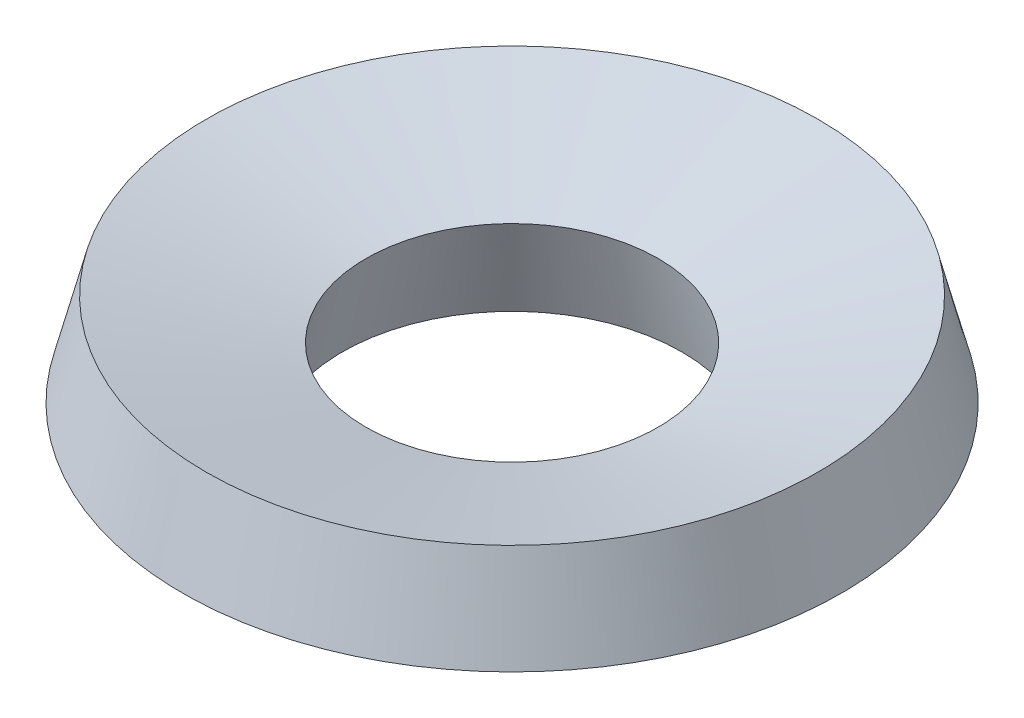
ISO-10303-21;
HEADER;
FILE_DESCRIPTION(('STEP AP214'),'2;1');
FILE_NAME('part.step','',(''),(''),'','','');
FILE_SCHEMA(('AUTOMOTIVE_DESIGN { 1 0 10303 214 1 1 1 1 }'));
ENDSEC;
DATA;
#1=APPLICATION_CONTEXT('core data for automotive mechanical design processes');
#2=APPLICATION_PROTOCOL_DEFINITION('international standard','automotive_design',2000,#1);
#3=PRODUCT_CONTEXT('',#1,'mechanical');
#4=PRODUCT('Part','Part','',(#3));
#5=PRODUCT_RELATED_PRODUCT_CATEGORY('part','',(#4));
#6=PRODUCT_DEFINITION_FORMATION('','',#4);
#7=PRODUCT_DEFINITION_CONTEXT('part definition',#1,'design');
#8=PRODUCT_DEFINITION('design','',#6,#7);
#9=PRODUCT_DEFINITION_SHAPE('','',#8);
#10=(LENGTH_UNIT() NAMED_UNIT(*) SI_UNIT(.MILLI.,.METRE.));
#11=(NAMED_UNIT(*) PLANE_ANGLE_UNIT() SI_UNIT($,.RADIAN.));
#12=(NAMED_UNIT(*) SI_UNIT($,.STERADIAN.) SOLID_ANGLE_UNIT());
#13=UNCERTAINTY_MEASURE_WITH_UNIT(LENGTH_MEASURE(1.E-05),#10,'distance_accuracy_value','');
#14=(GEOMETRIC_REPRESENTATION_CONTEXT(3) GLOBAL_UNCERTAINTY_ASSIGNED_CONTEXT((#13)) GLOBAL_UNIT_ASSIGNED_CONTEXT((#10,
#11,#12)) REPRESENTATION_CONTEXT('',''));
#15=CARTESIAN_POINT('',(0.,0.,0.));
#16=DIRECTION('',(0.,0.,1.));
#17=DIRECTION('',(1.,0.,0.));
#18=AXIS2_PLACEMENT_3D('',#15,#16,#17);
#19=CARTESIAN_POINT('',(0.,5.0000000000407,0.));
#20=DIRECTION('',(0.,1.,0.));
#21=DIRECTION('',(-1.,0.,0.));
#22=AXIS2_PLACEMENT_3D('',#19,#20,#21);
#23=CONICAL_SURFACE('',#22,16.4709302325896,1.32035323718);
#24=CARTESIAN_POINT('',(0.,2.79999999999971,0.));
#25=DIRECTION('',(0.,-1.,0.));
#26=DIRECTION('',(0.,0.,-1.));
#27=AXIS2_PLACEMENT_3D('',#24,#25,#26);
#28=CIRCLE('',#27,7.87093023255887);
#29=CARTESIAN_POINT('',(0.,2.79999999999971,-7.87093023255887));
#30=VERTEX_POINT('',#29);
#31=EDGE_CURVE('E18',#30,#30,#28,.T.);
#32=ORIENTED_EDGE('',*,*,#31,.T.);
#33=EDGE_LOOP('',(#32));
#34=FACE_BOUND('',#33,.T.);
#35=CARTESIAN_POINT('',(0.,4.99999999998771,0.));
#36=DIRECTION('',(0.,-1.,0.));
#37=DIRECTION('',(0.,0.,-1.));
#38=AXIS2_PLACEMENT_3D('',#35,#36,#37);
#39=CIRCLE('',#38,16.4709302325519);
#40=CARTESIAN_POINT('',(0.,4.99999999998771,-16.4709302325519));
#41=VERTEX_POINT('',#40);
#42=EDGE_CURVE('E27',#41,#41,#39,.T.);
#43=ORIENTED_EDGE('',*,*,#42,.F.);
#44=EDGE_LOOP('',(#43));
#45=FACE_BOUND('',#44,.T.);
#46=ADVANCED_FACE('F15',(#34,#45),#23,.F.);
#47=CARTESIAN_POINT('',(0.,-2.20000000000029,0.));
#48=DIRECTION('',(0.,-1.,0.));
#49=DIRECTION('',(1.,0.,0.));
#50=AXIS2_PLACEMENT_3D('',#47,#48,#49);
#51=CONICAL_SURFACE('',#50,9.14999999999886,0.250443089611);
#52=CARTESIAN_POINT('',(0.,-2.19999999999939,0.));
#53=DIRECTION('',(0.,1.,0.));
#54=DIRECTION('',(0.,0.,-1.));
#55=AXIS2_PLACEMENT_3D('',#52,#53,#54);
#56=CIRCLE('',#55,9.14999999999984);
#57=CARTESIAN_POINT('',(0.,-2.19999999999939,-9.14999999999984));
#58=VERTEX_POINT('',#57);
#59=EDGE_CURVE('E22',#58,#58,#56,.T.);
#60=ORIENTED_EDGE('',*,*,#59,.F.);
#61=EDGE_LOOP('',(#60));
#62=FACE_BOUND('',#61,.T.);
#63=ORIENTED_EDGE('',*,*,#31,.F.);
#64=EDGE_LOOP('',(#63));
#65=FACE_BOUND('',#64,.T.);
#66=ADVANCED_FACE('F37',(#62,#65),#51,.F.);
#67=CARTESIAN_POINT('',(0.,-2.69055611124003E-12,0.));
#68=DIRECTION('',(0.,-1.,0.));
#69=DIRECTION('',(1.,0.,0.));
#70=AXIS2_PLACEMENT_3D('',#67,#68,#69);
#71=CONICAL_SURFACE('',#70,17.7499999999895,0.250443089611);
#72=ORIENTED_EDGE('',*,*,#42,.T.);
#73=EDGE_LOOP('',(#72));
#74=FACE_BOUND('',#73,.T.);
#75=CARTESIAN_POINT('',(0.,3.10949183068843E-11,0.));
#76=DIRECTION('',(0.,1.,0.));
#77=DIRECTION('',(0.,0.,-1.));
#78=AXIS2_PLACEMENT_3D('',#75,#76,#77);
#79=CIRCLE('',#78,17.749999999992);
#80=CARTESIAN_POINT('',(0.,3.10953519877533E-11,-17.749999999992));
#81=VERTEX_POINT('',#80);
#82=EDGE_CURVE('E10',#81,#81,#79,.F.);
#83=ORIENTED_EDGE('',*,*,#82,.F.);
#84=EDGE_LOOP('',(#83));
#85=FACE_BOUND('',#84,.T.);
#86=ADVANCED_FACE('F39',(#74,#85),#71,.T.);
#87=CARTESIAN_POINT('',(0.,3.10962193494912E-11,0.));
#88=DIRECTION('',(0.,1.,0.));
#89=DIRECTION('',(-1.,0.,0.));
#90=AXIS2_PLACEMENT_3D('',#87,#88,#89);
#91=CONICAL_SURFACE('',#90,17.749999999992,1.32035323718);
#92=ORIENTED_EDGE('',*,*,#82,.T.);
#93=EDGE_LOOP('',(#92));
#94=FACE_BOUND('',#93,.T.);
#95=ORIENTED_EDGE('',*,*,#59,.T.);
#96=EDGE_LOOP('',(#95));
#97=FACE_BOUND('',#96,.T.);
#98=ADVANCED_FACE('F46',(#94,#97),#91,.T.);
#99=CLOSED_SHELL('',(#46,#66,#86,#98));
#100=MANIFOLD_SOLID_BREP('B1',#99);
#101=ADVANCED_BREP_SHAPE_REPRESENTATION('',(#18,#100),#14);
#102=SHAPE_DEFINITION_REPRESENTATION(#9,#101);
ENDSEC;
END-ISO-10303-21;
